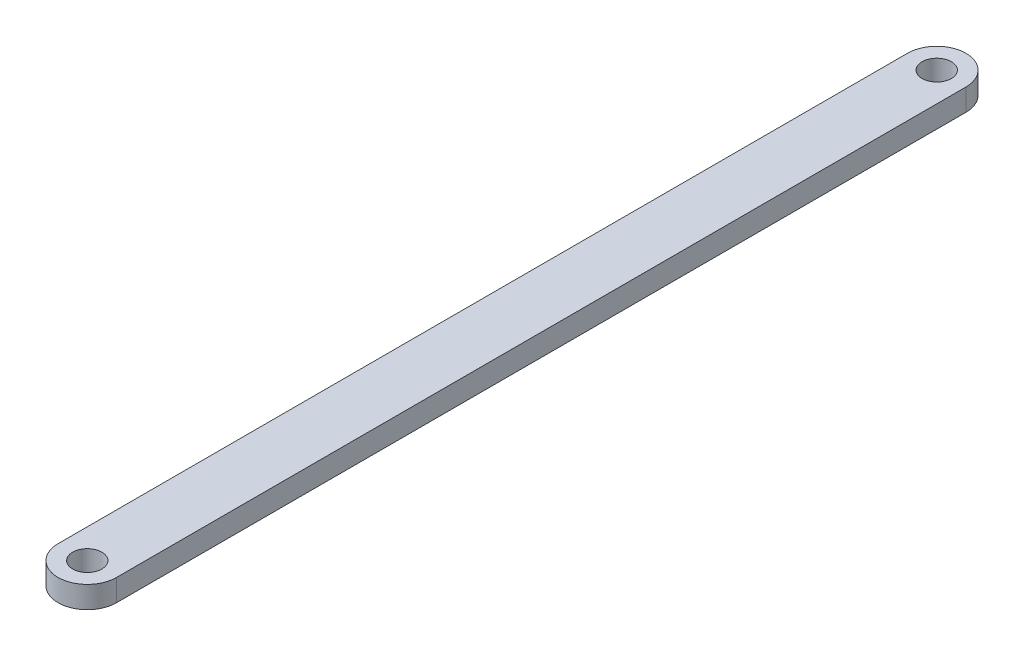
ISO-10303-21;
HEADER;
FILE_DESCRIPTION(('STEP AP214'),'2;1');
FILE_NAME('part.step','',(''),(''),'','','');
FILE_SCHEMA(('AUTOMOTIVE_DESIGN { 1 0 10303 214 1 1 1 1 }'));
ENDSEC;
DATA;
#1=APPLICATION_CONTEXT('core data for automotive mechanical design processes');
#2=APPLICATION_PROTOCOL_DEFINITION('international standard','automotive_design',2000,#1);
#3=PRODUCT_CONTEXT('',#1,'mechanical');
#4=PRODUCT('Part','Part','',(#3));
#5=PRODUCT_RELATED_PRODUCT_CATEGORY('part','',(#4));
#6=PRODUCT_DEFINITION_FORMATION('','',#4);
#7=PRODUCT_DEFINITION_CONTEXT('part definition',#1,'design');
#8=PRODUCT_DEFINITION('design','',#6,#7);
#9=PRODUCT_DEFINITION_SHAPE('','',#8);
#10=(LENGTH_UNIT() NAMED_UNIT(*) SI_UNIT(.MILLI.,.METRE.));
#11=(NAMED_UNIT(*) PLANE_ANGLE_UNIT() SI_UNIT($,.RADIAN.));
#12=(NAMED_UNIT(*) SI_UNIT($,.STERADIAN.) SOLID_ANGLE_UNIT());
#13=UNCERTAINTY_MEASURE_WITH_UNIT(LENGTH_MEASURE(1.E-05),#10,'distance_accuracy_value','');
#14=(GEOMETRIC_REPRESENTATION_CONTEXT(3) GLOBAL_UNCERTAINTY_ASSIGNED_CONTEXT((#13)) GLOBAL_UNIT_ASSIGNED_CONTEXT((#10,
#11,#12)) REPRESENTATION_CONTEXT('',''));
#15=CARTESIAN_POINT('',(0.,0.,0.));
#16=DIRECTION('',(0.,0.,1.));
#17=DIRECTION('',(1.,0.,0.));
#18=AXIS2_PLACEMENT_3D('',#15,#16,#17);
#19=CARTESIAN_POINT('',(0.,3.,-58.125));
#20=DIRECTION('',(0.,1.,0.));
#21=DIRECTION('',(0.,0.,1.));
#22=AXIS2_PLACEMENT_3D('',#19,#20,#21);
#23=PLANE('',#22);
#24=CARTESIAN_POINT('',(0.,3.,-58.125));
#25=DIRECTION('',(0.,1.,0.));
#26=DIRECTION('',(0.,0.,1.));
#27=AXIS2_PLACEMENT_3D('',#24,#25,#26);
#28=CIRCLE('',#27,2.);
#29=CARTESIAN_POINT('',(0.,3.,-56.125));
#30=VERTEX_POINT('',#29);
#31=EDGE_CURVE('E116',#30,#30,#28,.T.);
#32=ORIENTED_EDGE('',*,*,#31,.F.);
#33=EDGE_LOOP('',(#32));
#34=FACE_BOUND('',#33,.T.);
#35=CARTESIAN_POINT('',(0.,3.,-58.125));
#36=DIRECTION('',(0.,1.,0.));
#37=DIRECTION('',(0.,0.,1.));
#38=AXIS2_PLACEMENT_3D('',#35,#36,#37);
#39=CIRCLE('',#38,4.);
#40=CARTESIAN_POINT('',(3.99999999999998,3.,-58.125));
#41=VERTEX_POINT('',#40);
#42=CARTESIAN_POINT('',(-4.00000000000002,3.,-58.125));
#43=VERTEX_POINT('',#42);
#44=EDGE_CURVE('E96',#41,#43,#39,.T.);
#45=ORIENTED_EDGE('',*,*,#44,.T.);
#46=DIRECTION('',(0.,0.,1.));
#47=VECTOR('',#46,1.);
#48=CARTESIAN_POINT('',(-4.00000000000002,3.,-58.125));
#49=LINE('',#48,#47);
#50=CARTESIAN_POINT('',(-3.99999999999999,3.,58.125));
#51=VERTEX_POINT('',#50);
#52=EDGE_CURVE('E91',#43,#51,#49,.T.);
#53=ORIENTED_EDGE('',*,*,#52,.T.);
#54=CARTESIAN_POINT('',(0.,3.,58.125));
#55=DIRECTION('',(0.,1.,0.));
#56=DIRECTION('',(0.,0.,1.));
#57=AXIS2_PLACEMENT_3D('',#54,#55,#56);
#58=CIRCLE('',#57,4.);
#59=CARTESIAN_POINT('',(4.00000000000001,3.,58.125));
#60=VERTEX_POINT('',#59);
#61=EDGE_CURVE('E94',#51,#60,#58,.T.);
#62=ORIENTED_EDGE('',*,*,#61,.T.);
#63=DIRECTION('',(0.,0.,-1.));
#64=VECTOR('',#63,1.);
#65=CARTESIAN_POINT('',(3.99999999999998,3.,-58.125));
#66=LINE('',#65,#64);
#67=EDGE_CURVE('E61',#60,#41,#66,.T.);
#68=ORIENTED_EDGE('',*,*,#67,.T.);
#69=EDGE_LOOP('',(#45,#53,#62,#68));
#70=FACE_BOUND('',#69,.T.);
#71=CARTESIAN_POINT('',(0.,3.,58.125));
#72=DIRECTION('',(0.,1.,0.));
#73=DIRECTION('',(0.,0.,1.));
#74=AXIS2_PLACEMENT_3D('',#71,#72,#73);
#75=CIRCLE('',#74,2.);
#76=CARTESIAN_POINT('',(0.,3.,60.125));
#77=VERTEX_POINT('',#76);
#78=EDGE_CURVE('E138',#77,#77,#75,.T.);
#79=ORIENTED_EDGE('',*,*,#78,.F.);
#80=EDGE_LOOP('',(#79));
#81=FACE_BOUND('',#80,.T.);
#82=ADVANCED_FACE('F43',(#34,#70,#81),#23,.T.);
#83=CARTESIAN_POINT('',(0.,0.,-58.125));
#84=DIRECTION('',(0.,1.,0.));
#85=DIRECTION('',(0.,0.,1.));
#86=AXIS2_PLACEMENT_3D('',#83,#84,#85);
#87=PLANE('',#86);
#88=CARTESIAN_POINT('',(0.,0.,-58.125));
#89=DIRECTION('',(0.,1.,0.));
#90=DIRECTION('',(0.,0.,1.));
#91=AXIS2_PLACEMENT_3D('',#88,#89,#90);
#92=CIRCLE('',#91,4.);
#93=CARTESIAN_POINT('',(3.99999999999998,0.,-58.125));
#94=VERTEX_POINT('',#93);
#95=CARTESIAN_POINT('',(-4.00000000000002,0.,-58.125));
#96=VERTEX_POINT('',#95);
#97=EDGE_CURVE('E112',#94,#96,#92,.T.);
#98=ORIENTED_EDGE('',*,*,#97,.F.);
#99=DIRECTION('',(0.,0.,-1.));
#100=VECTOR('',#99,1.);
#101=CARTESIAN_POINT('',(3.99999999999998,0.,-58.125));
#102=LINE('',#101,#100);
#103=CARTESIAN_POINT('',(4.00000000000001,0.,58.125));
#104=VERTEX_POINT('',#103);
#105=EDGE_CURVE('E84',#104,#94,#102,.T.);
#106=ORIENTED_EDGE('',*,*,#105,.F.);
#107=CARTESIAN_POINT('',(0.,0.,58.125));
#108=DIRECTION('',(0.,1.,0.));
#109=DIRECTION('',(0.,0.,1.));
#110=AXIS2_PLACEMENT_3D('',#107,#108,#109);
#111=CIRCLE('',#110,4.);
#112=CARTESIAN_POINT('',(-3.99999999999999,0.,58.125));
#113=VERTEX_POINT('',#112);
#114=EDGE_CURVE('E78',#113,#104,#111,.T.);
#115=ORIENTED_EDGE('',*,*,#114,.F.);
#116=DIRECTION('',(0.,0.,1.));
#117=VECTOR('',#116,1.);
#118=CARTESIAN_POINT('',(-4.00000000000002,0.,-58.125));
#119=LINE('',#118,#117);
#120=EDGE_CURVE('E101',#96,#113,#119,.T.);
#121=ORIENTED_EDGE('',*,*,#120,.F.);
#122=EDGE_LOOP('',(#98,#106,#115,#121));
#123=FACE_BOUND('',#122,.T.);
#124=CARTESIAN_POINT('',(0.,0.,-58.125));
#125=DIRECTION('',(0.,1.,0.));
#126=DIRECTION('',(0.,0.,1.));
#127=AXIS2_PLACEMENT_3D('',#124,#125,#126);
#128=CIRCLE('',#127,2.);
#129=CARTESIAN_POINT('',(0.,0.,-56.125));
#130=VERTEX_POINT('',#129);
#131=EDGE_CURVE('E134',#130,#130,#128,.T.);
#132=ORIENTED_EDGE('',*,*,#131,.T.);
#133=EDGE_LOOP('',(#132));
#134=FACE_BOUND('',#133,.T.);
#135=CARTESIAN_POINT('',(0.,0.,58.125));
#136=DIRECTION('',(0.,1.,0.));
#137=DIRECTION('',(0.,0.,1.));
#138=AXIS2_PLACEMENT_3D('',#135,#136,#137);
#139=CIRCLE('',#138,2.);
#140=CARTESIAN_POINT('',(0.,0.,60.125));
#141=VERTEX_POINT('',#140);
#142=EDGE_CURVE('E142',#141,#141,#139,.T.);
#143=ORIENTED_EDGE('',*,*,#142,.T.);
#144=EDGE_LOOP('',(#143));
#145=FACE_BOUND('',#144,.T.);
#146=ADVANCED_FACE('F129',(#123,#134,#145),#87,.F.);
#147=CARTESIAN_POINT('',(0.,3.,-58.125));
#148=DIRECTION('',(0.,-1.,0.));
#149=DIRECTION('',(0.,0.,-1.));
#150=AXIS2_PLACEMENT_3D('',#147,#148,#149);
#151=CYLINDRICAL_SURFACE('',#150,4.);
#152=ORIENTED_EDGE('',*,*,#97,.T.);
#153=DIRECTION('',(0.,-1.,0.));
#154=VECTOR('',#153,1.);
#155=CARTESIAN_POINT('',(-4.00000000000002,3.,-58.125));
#156=LINE('',#155,#154);
#157=EDGE_CURVE('E11',#43,#96,#156,.T.);
#158=ORIENTED_EDGE('',*,*,#157,.F.);
#159=ORIENTED_EDGE('',*,*,#44,.F.);
#160=DIRECTION('',(0.,-1.,0.));
#161=VECTOR('',#160,1.);
#162=CARTESIAN_POINT('',(3.99999999999998,3.,-58.125));
#163=LINE('',#162,#161);
#164=EDGE_CURVE('E108',#41,#94,#163,.T.);
#165=ORIENTED_EDGE('',*,*,#164,.T.);
#166=EDGE_LOOP('',(#152,#158,#159,#165));
#167=FACE_BOUND('',#166,.T.);
#168=ADVANCED_FACE('F45',(#167),#151,.T.);
#169=CARTESIAN_POINT('',(-4.00000000000002,3.,-58.125));
#170=DIRECTION('',(1.,0.,0.));
#171=DIRECTION('',(0.,0.,-1.));
#172=AXIS2_PLACEMENT_3D('',#169,#170,#171);
#173=PLANE('',#172);
#174=ORIENTED_EDGE('',*,*,#120,.T.);
#175=DIRECTION('',(0.,-1.,0.));
#176=VECTOR('',#175,1.);
#177=CARTESIAN_POINT('',(-3.99999999999999,3.,58.125));
#178=LINE('',#177,#176);
#179=EDGE_CURVE('E53',#51,#113,#178,.T.);
#180=ORIENTED_EDGE('',*,*,#179,.F.);
#181=ORIENTED_EDGE('',*,*,#52,.F.);
#182=ORIENTED_EDGE('',*,*,#157,.T.);
#183=EDGE_LOOP('',(#174,#180,#181,#182));
#184=FACE_BOUND('',#183,.T.);
#185=ADVANCED_FACE('F100',(#184),#173,.F.);
#186=CARTESIAN_POINT('',(0.,3.,58.125));
#187=DIRECTION('',(0.,-1.,0.));
#188=DIRECTION('',(0.,0.,-1.));
#189=AXIS2_PLACEMENT_3D('',#186,#187,#188);
#190=CYLINDRICAL_SURFACE('',#189,4.);
#191=ORIENTED_EDGE('',*,*,#114,.T.);
#192=DIRECTION('',(0.,-1.,0.));
#193=VECTOR('',#192,1.);
#194=CARTESIAN_POINT('',(4.00000000000001,3.,58.125));
#195=LINE('',#194,#193);
#196=EDGE_CURVE('E103',#60,#104,#195,.T.);
#197=ORIENTED_EDGE('',*,*,#196,.F.);
#198=ORIENTED_EDGE('',*,*,#61,.F.);
#199=ORIENTED_EDGE('',*,*,#179,.T.);
#200=EDGE_LOOP('',(#191,#197,#198,#199));
#201=FACE_BOUND('',#200,.T.);
#202=ADVANCED_FACE('F104',(#201),#190,.T.);
#203=CARTESIAN_POINT('',(3.99999999999998,3.,-58.125));
#204=DIRECTION('',(-1.,0.,0.));
#205=DIRECTION('',(0.,0.,1.));
#206=AXIS2_PLACEMENT_3D('',#203,#204,#205);
#207=PLANE('',#206);
#208=ORIENTED_EDGE('',*,*,#105,.T.);
#209=ORIENTED_EDGE('',*,*,#164,.F.);
#210=ORIENTED_EDGE('',*,*,#67,.F.);
#211=ORIENTED_EDGE('',*,*,#196,.T.);
#212=EDGE_LOOP('',(#208,#209,#210,#211));
#213=FACE_BOUND('',#212,.T.);
#214=ADVANCED_FACE('F126',(#213),#207,.F.);
#215=CARTESIAN_POINT('',(0.,3.,-58.125));
#216=DIRECTION('',(0.,-1.,0.));
#217=DIRECTION('',(0.,0.,-1.));
#218=AXIS2_PLACEMENT_3D('',#215,#216,#217);
#219=CYLINDRICAL_SURFACE('',#218,2.);
#220=ORIENTED_EDGE('',*,*,#31,.T.);
#221=EDGE_LOOP('',(#220));
#222=FACE_BOUND('',#221,.T.);
#223=ORIENTED_EDGE('',*,*,#131,.F.);
#224=EDGE_LOOP('',(#223));
#225=FACE_BOUND('',#224,.T.);
#226=ADVANCED_FACE('F161',(#222,#225),#219,.F.);
#227=CARTESIAN_POINT('',(0.,3.,58.125));
#228=DIRECTION('',(0.,-1.,0.));
#229=DIRECTION('',(0.,0.,-1.));
#230=AXIS2_PLACEMENT_3D('',#227,#228,#229);
#231=CYLINDRICAL_SURFACE('',#230,2.);
#232=ORIENTED_EDGE('',*,*,#78,.T.);
#233=EDGE_LOOP('',(#232));
#234=FACE_BOUND('',#233,.T.);
#235=ORIENTED_EDGE('',*,*,#142,.F.);
#236=EDGE_LOOP('',(#235));
#237=FACE_BOUND('',#236,.T.);
#238=ADVANCED_FACE('F150',(#234,#237),#231,.F.);
#239=CLOSED_SHELL('',(#82,#146,#168,#185,#202,#214,#226,#238));
#240=MANIFOLD_SOLID_BREP('B2',#239);
#241=ADVANCED_BREP_SHAPE_REPRESENTATION('',(#18,#240),#14);
#242=SHAPE_DEFINITION_REPRESENTATION(#9,#241);
ENDSEC;
END-ISO-10303-21;
